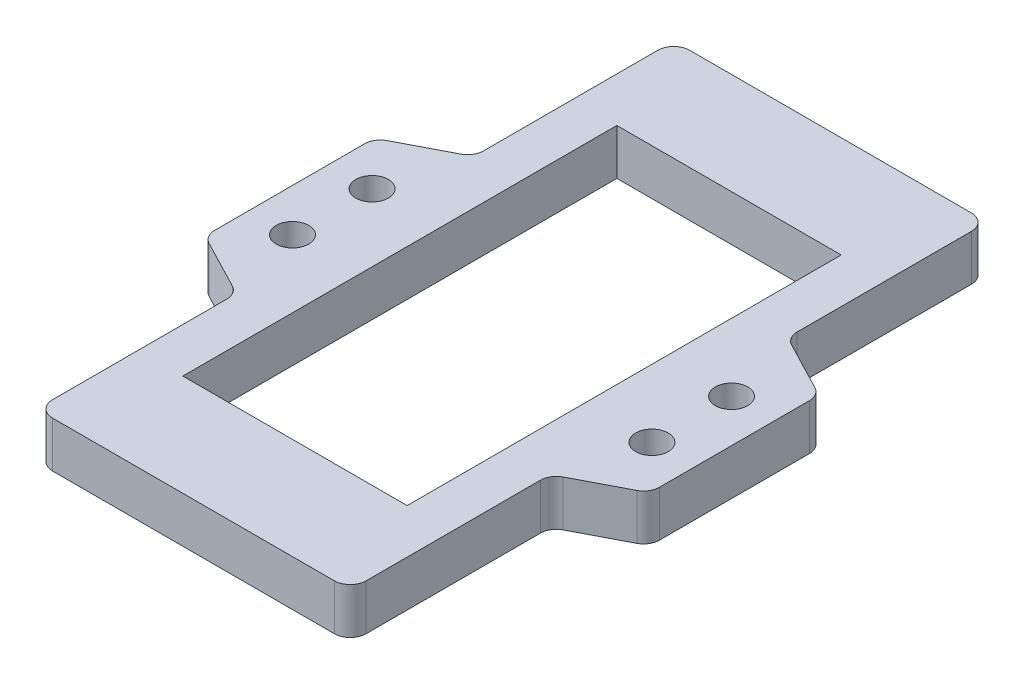
ISO-10303-21;
HEADER;
FILE_DESCRIPTION(('STEP AP214'),'2;1');
FILE_NAME('part.step','',(''),(''),'','','');
FILE_SCHEMA(('AUTOMOTIVE_DESIGN { 1 0 10303 214 1 1 1 1 }'));
ENDSEC;
DATA;
#1=APPLICATION_CONTEXT('core data for automotive mechanical design processes');
#2=APPLICATION_PROTOCOL_DEFINITION('international standard','automotive_design',2000,#1);
#3=PRODUCT_CONTEXT('',#1,'mechanical');
#4=PRODUCT('Part','Part','',(#3));
#5=PRODUCT_RELATED_PRODUCT_CATEGORY('part','',(#4));
#6=PRODUCT_DEFINITION_FORMATION('','',#4);
#7=PRODUCT_DEFINITION_CONTEXT('part definition',#1,'design');
#8=PRODUCT_DEFINITION('design','',#6,#7);
#9=PRODUCT_DEFINITION_SHAPE('','',#8);
#10=(LENGTH_UNIT() NAMED_UNIT(*) SI_UNIT(.MILLI.,.METRE.));
#11=(NAMED_UNIT(*) PLANE_ANGLE_UNIT() SI_UNIT($,.RADIAN.));
#12=(NAMED_UNIT(*) SI_UNIT($,.STERADIAN.) SOLID_ANGLE_UNIT());
#13=UNCERTAINTY_MEASURE_WITH_UNIT(LENGTH_MEASURE(1.E-05),#10,'distance_accuracy_value','');
#14=(GEOMETRIC_REPRESENTATION_CONTEXT(3) GLOBAL_UNCERTAINTY_ASSIGNED_CONTEXT((#13)) GLOBAL_UNIT_ASSIGNED_CONTEXT((#10,
#11,#12)) REPRESENTATION_CONTEXT('',''));
#15=CARTESIAN_POINT('',(0.,0.,0.));
#16=DIRECTION('',(0.,0.,1.));
#17=DIRECTION('',(1.,0.,0.));
#18=AXIS2_PLACEMENT_3D('',#15,#16,#17);
#19=CARTESIAN_POINT('',(0.,7.3152,0.));
#20=DIRECTION('',(0.,1.,0.));
#21=DIRECTION('',(0.,0.,1.));
#22=AXIS2_PLACEMENT_3D('',#19,#20,#21);
#23=PLANE('',#22);
#24=DIRECTION('',(0.,0.,1.));
#25=VECTOR('',#24,1.);
#26=CARTESIAN_POINT('',(-17.885,7.3152,-34.6075));
#27=LINE('',#26,#25);
#28=CARTESIAN_POINT('',(-17.885,7.3152,-34.6075));
#29=VERTEX_POINT('',#28);
#30=CARTESIAN_POINT('',(-17.885,7.3152,34.6075));
#31=VERTEX_POINT('',#30);
#32=EDGE_CURVE('E53',#29,#31,#27,.T.);
#33=ORIENTED_EDGE('',*,*,#32,.F.);
#34=DIRECTION('',(-1.,0.,0.));
#35=VECTOR('',#34,1.);
#36=CARTESIAN_POINT('',(17.885,7.3152,-34.6075));
#37=LINE('',#36,#35);
#38=CARTESIAN_POINT('',(17.885,7.3152,-34.6075));
#39=VERTEX_POINT('',#38);
#40=EDGE_CURVE('E240',#39,#29,#37,.T.);
#41=ORIENTED_EDGE('',*,*,#40,.F.);
#42=DIRECTION('',(0.,0.,-1.));
#43=VECTOR('',#42,1.);
#44=CARTESIAN_POINT('',(17.885,7.3152,-34.6075));
#45=LINE('',#44,#43);
#46=CARTESIAN_POINT('',(17.885,7.3152,34.6075));
#47=VERTEX_POINT('',#46);
#48=EDGE_CURVE('E243',#47,#39,#45,.T.);
#49=ORIENTED_EDGE('',*,*,#48,.F.);
#50=DIRECTION('',(1.,0.,0.));
#51=VECTOR('',#50,1.);
#52=CARTESIAN_POINT('',(17.885,7.3152,34.6075));
#53=LINE('',#52,#51);
#54=EDGE_CURVE('E249',#31,#47,#53,.T.);
#55=ORIENTED_EDGE('',*,*,#54,.F.);
#56=EDGE_LOOP('',(#33,#41,#49,#55));
#57=FACE_BOUND('',#56,.T.);
#58=DIRECTION('',(0.,0.,1.));
#59=VECTOR('',#58,1.);
#60=CARTESIAN_POINT('',(-35.472859966,7.3152,50.8));
#61=LINE('',#60,#59);
#62=CARTESIAN_POINT('',(-35.472859966,7.3152,-11.9477623690497));
#63=VERTEX_POINT('',#62);
#64=CARTESIAN_POINT('',(-35.472859966,7.3152,11.9477623690497));
#65=VERTEX_POINT('',#64);
#66=EDGE_CURVE('E331',#63,#65,#61,.T.);
#67=ORIENTED_EDGE('',*,*,#66,.T.);
#68=CARTESIAN_POINT('',(-32.932859966,7.3152,11.9477623690497));
#69=DIRECTION('',(0.,1.,0.));
#70=DIRECTION('',(0.,0.,1.));
#71=AXIS2_PLACEMENT_3D('',#68,#69,#70);
#72=CIRCLE('',#71,2.54);
#73=CARTESIAN_POINT('',(-34.1044985055158,7.3152,14.2013956872098));
#74=VERTEX_POINT('',#73);
#75=EDGE_CURVE('E403',#65,#74,#72,.T.);
#76=ORIENTED_EDGE('',*,*,#75,.T.);
#77=DIRECTION('',(0.887257211874052,0.,0.461275015557403));
#78=VECTOR('',#77,1.);
#79=CARTESIAN_POINT('',(-35.472859966,7.3152,13.49));
#80=LINE('',#79,#78);
#81=CARTESIAN_POINT('',(-26.3756204872549,7.3152,18.2195521816319));
#82=VERTEX_POINT('',#81);
#83=EDGE_CURVE('E287',#74,#82,#80,.T.);
#84=ORIENTED_EDGE('',*,*,#83,.T.);
#85=CARTESIAN_POINT('',(-27.5472590267708,7.3152,20.473185499792));
#86=DIRECTION('',(0.,1.,0.));
#87=DIRECTION('',(0.,0.,1.));
#88=AXIS2_PLACEMENT_3D('',#85,#86,#87);
#89=CIRCLE('',#88,2.54);
#90=CARTESIAN_POINT('',(-25.0072590267708,7.3152,20.473185499792));
#91=VERTEX_POINT('',#90);
#92=EDGE_CURVE('E449',#82,#91,#89,.F.);
#93=ORIENTED_EDGE('',*,*,#92,.T.);
#94=DIRECTION('',(0.,0.,1.));
#95=VECTOR('',#94,1.);
#96=CARTESIAN_POINT('',(-25.0072590267708,7.3152,18.9309478688417));
#97=LINE('',#96,#95);
#98=CARTESIAN_POINT('',(-25.0072590267708,7.3152,48.26));
#99=VERTEX_POINT('',#98);
#100=EDGE_CURVE('E278',#91,#99,#97,.T.);
#101=ORIENTED_EDGE('',*,*,#100,.T.);
#102=CARTESIAN_POINT('',(-22.4672590267708,7.3152,48.26));
#103=DIRECTION('',(0.,1.,0.));
#104=DIRECTION('',(0.,0.,1.));
#105=AXIS2_PLACEMENT_3D('',#102,#103,#104);
#106=CIRCLE('',#105,2.54);
#107=CARTESIAN_POINT('',(-22.4672590267707,7.3152,50.8));
#108=VERTEX_POINT('',#107);
#109=EDGE_CURVE('E401',#99,#108,#106,.T.);
#110=ORIENTED_EDGE('',*,*,#109,.T.);
#111=DIRECTION('',(1.,0.,0.));
#112=VECTOR('',#111,1.);
#113=CARTESIAN_POINT('',(35.472859966,7.3152,50.8));
#114=LINE('',#113,#112);
#115=CARTESIAN_POINT('',(22.4672590267708,7.3152,50.8));
#116=VERTEX_POINT('',#115);
#117=EDGE_CURVE('E334',#108,#116,#114,.T.);
#118=ORIENTED_EDGE('',*,*,#117,.T.);
#119=CARTESIAN_POINT('',(22.4672590267708,7.3152,48.26));
#120=DIRECTION('',(0.,1.,0.));
#121=DIRECTION('',(0.,0.,1.));
#122=AXIS2_PLACEMENT_3D('',#119,#120,#121);
#123=CIRCLE('',#122,2.54);
#124=CARTESIAN_POINT('',(25.0072590267708,7.3152,48.26));
#125=VERTEX_POINT('',#124);
#126=EDGE_CURVE('E399',#116,#125,#123,.T.);
#127=ORIENTED_EDGE('',*,*,#126,.T.);
#128=DIRECTION('',(0.,0.,1.));
#129=VECTOR('',#128,1.);
#130=CARTESIAN_POINT('',(25.0072590267708,7.3152,18.9309478688417));
#131=LINE('',#130,#129);
#132=CARTESIAN_POINT('',(25.0072590267708,7.3152,20.473185499792));
#133=VERTEX_POINT('',#132);
#134=EDGE_CURVE('E263',#133,#125,#131,.T.);
#135=ORIENTED_EDGE('',*,*,#134,.F.);
#136=CARTESIAN_POINT('',(27.5472590267708,7.3152,20.473185499792));
#137=DIRECTION('',(0.,1.,0.));
#138=DIRECTION('',(0.,0.,1.));
#139=AXIS2_PLACEMENT_3D('',#136,#137,#138);
#140=CIRCLE('',#139,2.54);
#141=CARTESIAN_POINT('',(26.3756204872549,7.3152,18.2195521816319));
#142=VERTEX_POINT('',#141);
#143=EDGE_CURVE('E453',#133,#142,#140,.F.);
#144=ORIENTED_EDGE('',*,*,#143,.T.);
#145=DIRECTION('',(-0.887257211874052,0.,0.461275015557403));
#146=VECTOR('',#145,1.);
#147=CARTESIAN_POINT('',(35.472859966,7.3152,13.49));
#148=LINE('',#147,#146);
#149=CARTESIAN_POINT('',(34.1044985055158,7.3152,14.2013956872098));
#150=VERTEX_POINT('',#149);
#151=EDGE_CURVE('E255',#150,#142,#148,.T.);
#152=ORIENTED_EDGE('',*,*,#151,.F.);
#153=CARTESIAN_POINT('',(32.932859966,7.3152,11.9477623690497));
#154=DIRECTION('',(0.,1.,0.));
#155=DIRECTION('',(0.,0.,1.));
#156=AXIS2_PLACEMENT_3D('',#153,#154,#155);
#157=CIRCLE('',#156,2.54);
#158=CARTESIAN_POINT('',(35.472859966,7.3152,11.9477623690497));
#159=VERTEX_POINT('',#158);
#160=EDGE_CURVE('E397',#150,#159,#157,.T.);
#161=ORIENTED_EDGE('',*,*,#160,.T.);
#162=DIRECTION('',(0.,0.,-1.));
#163=VECTOR('',#162,1.);
#164=CARTESIAN_POINT('',(35.472859966,7.3152,50.8));
#165=LINE('',#164,#163);
#166=CARTESIAN_POINT('',(35.472859966,7.3152,-11.9477623690497));
#167=VERTEX_POINT('',#166);
#168=EDGE_CURVE('E338',#159,#167,#165,.T.);
#169=ORIENTED_EDGE('',*,*,#168,.T.);
#170=CARTESIAN_POINT('',(32.932859966,7.3152,-11.9477623690497));
#171=DIRECTION('',(0.,1.,0.));
#172=DIRECTION('',(0.,0.,1.));
#173=AXIS2_PLACEMENT_3D('',#170,#171,#172);
#174=CIRCLE('',#173,2.54);
#175=CARTESIAN_POINT('',(34.1044985055158,7.3152,-14.2013956872098));
#176=VERTEX_POINT('',#175);
#177=EDGE_CURVE('E395',#167,#176,#174,.T.);
#178=ORIENTED_EDGE('',*,*,#177,.T.);
#179=DIRECTION('',(-0.887257211874052,0.,-0.461275015557403));
#180=VECTOR('',#179,1.);
#181=CARTESIAN_POINT('',(35.472859966,7.3152,-13.49));
#182=LINE('',#181,#180);
#183=CARTESIAN_POINT('',(26.3756204872549,7.3152,-18.2195521816319));
#184=VERTEX_POINT('',#183);
#185=EDGE_CURVE('E275',#176,#184,#182,.T.);
#186=ORIENTED_EDGE('',*,*,#185,.T.);
#187=CARTESIAN_POINT('',(27.5472590267708,7.3152,-20.473185499792));
#188=DIRECTION('',(0.,1.,0.));
#189=DIRECTION('',(0.,0.,1.));
#190=AXIS2_PLACEMENT_3D('',#187,#188,#189);
#191=CIRCLE('',#190,2.54);
#192=CARTESIAN_POINT('',(25.0072590267708,7.3152,-20.473185499792));
#193=VERTEX_POINT('',#192);
#194=EDGE_CURVE('E46',#184,#193,#191,.F.);
#195=ORIENTED_EDGE('',*,*,#194,.T.);
#196=DIRECTION('',(0.,0.,-1.));
#197=VECTOR('',#196,1.);
#198=CARTESIAN_POINT('',(25.0072590267708,7.3152,-18.9309478688417));
#199=LINE('',#198,#197);
#200=CARTESIAN_POINT('',(25.0072590267708,7.3152,-48.26));
#201=VERTEX_POINT('',#200);
#202=EDGE_CURVE('E266',#193,#201,#199,.T.);
#203=ORIENTED_EDGE('',*,*,#202,.T.);
#204=CARTESIAN_POINT('',(22.4672590267708,7.3152,-48.26));
#205=DIRECTION('',(0.,1.,0.));
#206=DIRECTION('',(0.,0.,1.));
#207=AXIS2_PLACEMENT_3D('',#204,#205,#206);
#208=CIRCLE('',#207,2.54);
#209=CARTESIAN_POINT('',(22.4672590267708,7.3152,-50.8));
#210=VERTEX_POINT('',#209);
#211=EDGE_CURVE('E393',#201,#210,#208,.T.);
#212=ORIENTED_EDGE('',*,*,#211,.T.);
#213=DIRECTION('',(-1.,0.,0.));
#214=VECTOR('',#213,1.);
#215=CARTESIAN_POINT('',(35.472859966,7.3152,-50.8));
#216=LINE('',#215,#214);
#217=CARTESIAN_POINT('',(-22.4672590267707,7.3152,-50.8));
#218=VERTEX_POINT('',#217);
#219=EDGE_CURVE('E341',#210,#218,#216,.T.);
#220=ORIENTED_EDGE('',*,*,#219,.T.);
#221=CARTESIAN_POINT('',(-22.4672590267708,7.3152,-48.26));
#222=DIRECTION('',(0.,1.,0.));
#223=DIRECTION('',(0.,0.,1.));
#224=AXIS2_PLACEMENT_3D('',#221,#222,#223);
#225=CIRCLE('',#224,2.54);
#226=CARTESIAN_POINT('',(-25.0072590267708,7.3152,-48.26));
#227=VERTEX_POINT('',#226);
#228=EDGE_CURVE('E357',#218,#227,#225,.T.);
#229=ORIENTED_EDGE('',*,*,#228,.T.);
#230=DIRECTION('',(0.,0.,-1.));
#231=VECTOR('',#230,1.);
#232=CARTESIAN_POINT('',(-25.0072590267708,7.3152,-18.9309478688417));
#233=LINE('',#232,#231);
#234=CARTESIAN_POINT('',(-25.0072590267708,7.3152,-20.473185499792));
#235=VERTEX_POINT('',#234);
#236=EDGE_CURVE('E299',#235,#227,#233,.T.);
#237=ORIENTED_EDGE('',*,*,#236,.F.);
#238=CARTESIAN_POINT('',(-27.5472590267708,7.3152,-20.473185499792));
#239=DIRECTION('',(0.,1.,0.));
#240=DIRECTION('',(0.,0.,1.));
#241=AXIS2_PLACEMENT_3D('',#238,#239,#240);
#242=CIRCLE('',#241,2.54);
#243=CARTESIAN_POINT('',(-26.3756204872549,7.3152,-18.2195521816319));
#244=VERTEX_POINT('',#243);
#245=EDGE_CURVE('E376',#235,#244,#242,.F.);
#246=ORIENTED_EDGE('',*,*,#245,.T.);
#247=DIRECTION('',(0.887257211874052,0.,-0.461275015557403));
#248=VECTOR('',#247,1.);
#249=CARTESIAN_POINT('',(-35.472859966,7.3152,-13.49));
#250=LINE('',#249,#248);
#251=CARTESIAN_POINT('',(-34.1044985055158,7.3152,-14.2013956872098));
#252=VERTEX_POINT('',#251);
#253=EDGE_CURVE('E290',#252,#244,#250,.T.);
#254=ORIENTED_EDGE('',*,*,#253,.F.);
#255=CARTESIAN_POINT('',(-32.932859966,7.3152,-11.9477623690497));
#256=DIRECTION('',(0.,1.,0.));
#257=DIRECTION('',(0.,0.,1.));
#258=AXIS2_PLACEMENT_3D('',#255,#256,#257);
#259=CIRCLE('',#258,2.54);
#260=EDGE_CURVE('E359',#252,#63,#259,.T.);
#261=ORIENTED_EDGE('',*,*,#260,.T.);
#262=EDGE_LOOP('',(#67,#76,#84,#93,#101,#110,#118,#127,#135,#144,#152,#161,#169,#178,#186,#195,
#203,#212,#220,#229,#237,#246,#254,#261));
#263=FACE_BOUND('',#262,.T.);
#264=CARTESIAN_POINT('',(28.662459966,7.3152,6.34999999999998));
#265=DIRECTION('',(0.,1.,0.));
#266=DIRECTION('',(0.,0.,1.));
#267=AXIS2_PLACEMENT_3D('',#264,#265,#266);
#268=CIRCLE('',#267,2.59079999999998);
#269=CARTESIAN_POINT('',(28.662459966,7.3152,8.94079999999997));
#270=VERTEX_POINT('',#269);
#271=EDGE_CURVE('E302',#270,#270,#268,.T.);
#272=ORIENTED_EDGE('',*,*,#271,.F.);
#273=EDGE_LOOP('',(#272));
#274=FACE_BOUND('',#273,.T.);
#275=CARTESIAN_POINT('',(28.662459966,7.3152,-6.35000000000002));
#276=DIRECTION('',(0.,1.,0.));
#277=DIRECTION('',(0.,0.,1.));
#278=AXIS2_PLACEMENT_3D('',#275,#276,#277);
#279=CIRCLE('',#278,2.59079999999998);
#280=CARTESIAN_POINT('',(28.662459966,7.3152,-3.75920000000003));
#281=VERTEX_POINT('',#280);
#282=EDGE_CURVE('E312',#281,#281,#279,.T.);
#283=ORIENTED_EDGE('',*,*,#282,.F.);
#284=EDGE_LOOP('',(#283));
#285=FACE_BOUND('',#284,.T.);
#286=CARTESIAN_POINT('',(-28.662459966,7.3152,6.34999999999998));
#287=DIRECTION('',(0.,1.,0.));
#288=DIRECTION('',(0.,0.,1.));
#289=AXIS2_PLACEMENT_3D('',#286,#287,#288);
#290=CIRCLE('',#289,2.59079999999999);
#291=CARTESIAN_POINT('',(-28.662459966,7.3152,8.94079999999997));
#292=VERTEX_POINT('',#291);
#293=EDGE_CURVE('E318',#292,#292,#290,.T.);
#294=ORIENTED_EDGE('',*,*,#293,.F.);
#295=EDGE_LOOP('',(#294));
#296=FACE_BOUND('',#295,.T.);
#297=CARTESIAN_POINT('',(-28.662459966,7.3152,-6.35000000000002));
#298=DIRECTION('',(0.,1.,0.));
#299=DIRECTION('',(0.,0.,1.));
#300=AXIS2_PLACEMENT_3D('',#297,#298,#299);
#301=CIRCLE('',#300,2.59079999999999);
#302=CARTESIAN_POINT('',(-28.662459966,7.3152,-3.75920000000003));
#303=VERTEX_POINT('',#302);
#304=EDGE_CURVE('E324',#303,#303,#301,.T.);
#305=ORIENTED_EDGE('',*,*,#304,.F.);
#306=EDGE_LOOP('',(#305));
#307=FACE_BOUND('',#306,.T.);
#308=ADVANCED_FACE('F38',(#57,#263,#274,#285,#296,#307),#23,.T.);
#309=CARTESIAN_POINT('',(0.,0.,0.));
#310=DIRECTION('',(0.,1.,0.));
#311=DIRECTION('',(0.,0.,1.));
#312=AXIS2_PLACEMENT_3D('',#309,#310,#311);
#313=PLANE('',#312);
#314=DIRECTION('',(-1.,0.,0.));
#315=VECTOR('',#314,1.);
#316=CARTESIAN_POINT('',(17.885,0.,-34.6075));
#317=LINE('',#316,#315);
#318=CARTESIAN_POINT('',(17.885,0.,-34.6075));
#319=VERTEX_POINT('',#318);
#320=CARTESIAN_POINT('',(-17.885,0.,-34.6075));
#321=VERTEX_POINT('',#320);
#322=EDGE_CURVE('E230',#319,#321,#317,.T.);
#323=ORIENTED_EDGE('',*,*,#322,.T.);
#324=DIRECTION('',(0.,0.,1.));
#325=VECTOR('',#324,1.);
#326=CARTESIAN_POINT('',(-17.885,0.,-34.6075));
#327=LINE('',#326,#325);
#328=CARTESIAN_POINT('',(-17.885,0.,34.6075));
#329=VERTEX_POINT('',#328);
#330=EDGE_CURVE('E224',#321,#329,#327,.T.);
#331=ORIENTED_EDGE('',*,*,#330,.T.);
#332=DIRECTION('',(1.,0.,0.));
#333=VECTOR('',#332,1.);
#334=CARTESIAN_POINT('',(17.885,0.,34.6075));
#335=LINE('',#334,#333);
#336=CARTESIAN_POINT('',(17.885,0.,34.6075));
#337=VERTEX_POINT('',#336);
#338=EDGE_CURVE('E233',#329,#337,#335,.T.);
#339=ORIENTED_EDGE('',*,*,#338,.T.);
#340=DIRECTION('',(0.,0.,-1.));
#341=VECTOR('',#340,1.);
#342=CARTESIAN_POINT('',(17.885,0.,-34.6075));
#343=LINE('',#342,#341);
#344=EDGE_CURVE('E61',#337,#319,#343,.T.);
#345=ORIENTED_EDGE('',*,*,#344,.T.);
#346=EDGE_LOOP('',(#323,#331,#339,#345));
#347=FACE_BOUND('',#346,.T.);
#348=CARTESIAN_POINT('',(28.662459966,0.,6.34999999999998));
#349=DIRECTION('',(0.,1.,0.));
#350=DIRECTION('',(0.,0.,1.));
#351=AXIS2_PLACEMENT_3D('',#348,#349,#350);
#352=CIRCLE('',#351,2.5908);
#353=CARTESIAN_POINT('',(28.662459966,0.,8.94079999999998));
#354=VERTEX_POINT('',#353);
#355=EDGE_CURVE('E309',#354,#354,#352,.T.);
#356=ORIENTED_EDGE('',*,*,#355,.T.);
#357=EDGE_LOOP('',(#356));
#358=FACE_BOUND('',#357,.T.);
#359=CARTESIAN_POINT('',(28.662459966,0.,-6.35000000000002));
#360=DIRECTION('',(0.,1.,0.));
#361=DIRECTION('',(0.,0.,1.));
#362=AXIS2_PLACEMENT_3D('',#359,#360,#361);
#363=CIRCLE('',#362,2.5908);
#364=CARTESIAN_POINT('',(28.662459966,0.,-3.75920000000002));
#365=VERTEX_POINT('',#364);
#366=EDGE_CURVE('E315',#365,#365,#363,.T.);
#367=ORIENTED_EDGE('',*,*,#366,.T.);
#368=EDGE_LOOP('',(#367));
#369=FACE_BOUND('',#368,.T.);
#370=CARTESIAN_POINT('',(-28.662459966,0.,6.34999999999998));
#371=DIRECTION('',(0.,1.,0.));
#372=DIRECTION('',(0.,0.,1.));
#373=AXIS2_PLACEMENT_3D('',#370,#371,#372);
#374=CIRCLE('',#373,2.5908);
#375=CARTESIAN_POINT('',(-28.662459966,0.,8.94079999999998));
#376=VERTEX_POINT('',#375);
#377=EDGE_CURVE('E321',#376,#376,#374,.T.);
#378=ORIENTED_EDGE('',*,*,#377,.T.);
#379=EDGE_LOOP('',(#378));
#380=FACE_BOUND('',#379,.T.);
#381=CARTESIAN_POINT('',(-28.662459966,0.,-6.35000000000002));
#382=DIRECTION('',(0.,1.,0.));
#383=DIRECTION('',(0.,0.,1.));
#384=AXIS2_PLACEMENT_3D('',#381,#382,#383);
#385=CIRCLE('',#384,2.5908);
#386=CARTESIAN_POINT('',(-28.662459966,0.,-3.75920000000002));
#387=VERTEX_POINT('',#386);
#388=EDGE_CURVE('E327',#387,#387,#385,.T.);
#389=ORIENTED_EDGE('',*,*,#388,.T.);
#390=EDGE_LOOP('',(#389));
#391=FACE_BOUND('',#390,.T.);
#392=DIRECTION('',(0.887257211874052,0.,0.461275015557403));
#393=VECTOR('',#392,1.);
#394=CARTESIAN_POINT('',(-35.472859966,0.,13.49));
#395=LINE('',#394,#393);
#396=CARTESIAN_POINT('',(-34.1044985055158,0.,14.2013956872098));
#397=VERTEX_POINT('',#396);
#398=CARTESIAN_POINT('',(-26.3756204872549,0.,18.2195521816319));
#399=VERTEX_POINT('',#398);
#400=EDGE_CURVE('E286',#397,#399,#395,.T.);
#401=ORIENTED_EDGE('',*,*,#400,.F.);
#402=CARTESIAN_POINT('',(-32.932859966,0.,11.9477623690497));
#403=DIRECTION('',(0.,1.,0.));
#404=DIRECTION('',(0.,0.,1.));
#405=AXIS2_PLACEMENT_3D('',#402,#403,#404);
#406=CIRCLE('',#405,2.54);
#407=CARTESIAN_POINT('',(-35.472859966,0.,11.9477623690497));
#408=VERTEX_POINT('',#407);
#409=EDGE_CURVE('E415',#397,#408,#406,.F.);
#410=ORIENTED_EDGE('',*,*,#409,.T.);
#411=DIRECTION('',(0.,0.,1.));
#412=VECTOR('',#411,1.);
#413=CARTESIAN_POINT('',(-35.472859966,0.,50.8));
#414=LINE('',#413,#412);
#415=CARTESIAN_POINT('',(-35.472859966,0.,-11.9477623690497));
#416=VERTEX_POINT('',#415);
#417=EDGE_CURVE('E330',#416,#408,#414,.T.);
#418=ORIENTED_EDGE('',*,*,#417,.F.);
#419=CARTESIAN_POINT('',(-32.932859966,0.,-11.9477623690497));
#420=DIRECTION('',(0.,1.,0.));
#421=DIRECTION('',(0.,0.,1.));
#422=AXIS2_PLACEMENT_3D('',#419,#420,#421);
#423=CIRCLE('',#422,2.54);
#424=CARTESIAN_POINT('',(-34.1044985055158,0.,-14.2013956872098));
#425=VERTEX_POINT('',#424);
#426=EDGE_CURVE('E366',#416,#425,#423,.F.);
#427=ORIENTED_EDGE('',*,*,#426,.T.);
#428=DIRECTION('',(0.887257211874052,0.,-0.461275015557403));
#429=VECTOR('',#428,1.);
#430=CARTESIAN_POINT('',(-35.472859966,0.,-13.49));
#431=LINE('',#430,#429);
#432=CARTESIAN_POINT('',(-26.3756204872549,0.,-18.2195521816319));
#433=VERTEX_POINT('',#432);
#434=EDGE_CURVE('E295',#425,#433,#431,.T.);
#435=ORIENTED_EDGE('',*,*,#434,.T.);
#436=CARTESIAN_POINT('',(-27.5472590267708,0.,-20.473185499792));
#437=DIRECTION('',(0.,1.,0.));
#438=DIRECTION('',(0.,0.,1.));
#439=AXIS2_PLACEMENT_3D('',#436,#437,#438);
#440=CIRCLE('',#439,2.54);
#441=CARTESIAN_POINT('',(-25.0072590267708,0.,-20.473185499792));
#442=VERTEX_POINT('',#441);
#443=EDGE_CURVE('E378',#433,#442,#440,.T.);
#444=ORIENTED_EDGE('',*,*,#443,.T.);
#445=DIRECTION('',(0.,0.,-1.));
#446=VECTOR('',#445,1.);
#447=CARTESIAN_POINT('',(-25.0072590267708,0.,-18.9309478688417));
#448=LINE('',#447,#446);
#449=CARTESIAN_POINT('',(-25.0072590267708,0.,-48.26));
#450=VERTEX_POINT('',#449);
#451=EDGE_CURVE('E298',#442,#450,#448,.T.);
#452=ORIENTED_EDGE('',*,*,#451,.T.);
#453=CARTESIAN_POINT('',(-22.4672590267708,0.,-48.26));
#454=DIRECTION('',(0.,1.,0.));
#455=DIRECTION('',(0.,0.,1.));
#456=AXIS2_PLACEMENT_3D('',#453,#454,#455);
#457=CIRCLE('',#456,2.54);
#458=CARTESIAN_POINT('',(-22.4672590267707,0.,-50.8));
#459=VERTEX_POINT('',#458);
#460=EDGE_CURVE('E363',#450,#459,#457,.F.);
#461=ORIENTED_EDGE('',*,*,#460,.T.);
#462=DIRECTION('',(-1.,0.,0.));
#463=VECTOR('',#462,1.);
#464=CARTESIAN_POINT('',(35.472859966,0.,-50.8));
#465=LINE('',#464,#463);
#466=CARTESIAN_POINT('',(22.4672590267708,0.,-50.8));
#467=VERTEX_POINT('',#466);
#468=EDGE_CURVE('E335',#467,#459,#465,.T.);
#469=ORIENTED_EDGE('',*,*,#468,.F.);
#470=CARTESIAN_POINT('',(22.4672590267708,0.,-48.26));
#471=DIRECTION('',(0.,1.,0.));
#472=DIRECTION('',(0.,0.,1.));
#473=AXIS2_PLACEMENT_3D('',#470,#471,#472);
#474=CIRCLE('',#473,2.54);
#475=CARTESIAN_POINT('',(25.0072590267708,0.,-48.26));
#476=VERTEX_POINT('',#475);
#477=EDGE_CURVE('E405',#467,#476,#474,.F.);
#478=ORIENTED_EDGE('',*,*,#477,.T.);
#479=DIRECTION('',(0.,0.,-1.));
#480=VECTOR('',#479,1.);
#481=CARTESIAN_POINT('',(25.0072590267708,0.,-18.9309478688417));
#482=LINE('',#481,#480);
#483=CARTESIAN_POINT('',(25.0072590267708,0.,-20.473185499792));
#484=VERTEX_POINT('',#483);
#485=EDGE_CURVE('E271',#484,#476,#482,.T.);
#486=ORIENTED_EDGE('',*,*,#485,.F.);
#487=CARTESIAN_POINT('',(27.5472590267708,0.,-20.473185499792));
#488=DIRECTION('',(0.,1.,0.));
#489=DIRECTION('',(0.,0.,1.));
#490=AXIS2_PLACEMENT_3D('',#487,#488,#489);
#491=CIRCLE('',#490,2.54);
#492=CARTESIAN_POINT('',(26.3756204872549,0.,-18.2195521816319));
#493=VERTEX_POINT('',#492);
#494=EDGE_CURVE('E11',#484,#493,#491,.T.);
#495=ORIENTED_EDGE('',*,*,#494,.T.);
#496=DIRECTION('',(-0.887257211874052,0.,-0.461275015557403));
#497=VECTOR('',#496,1.);
#498=CARTESIAN_POINT('',(35.472859966,0.,-13.49));
#499=LINE('',#498,#497);
#500=CARTESIAN_POINT('',(34.1044985055158,0.,-14.2013956872098));
#501=VERTEX_POINT('',#500);
#502=EDGE_CURVE('E274',#501,#493,#499,.T.);
#503=ORIENTED_EDGE('',*,*,#502,.F.);
#504=CARTESIAN_POINT('',(32.932859966,0.,-11.9477623690497));
#505=DIRECTION('',(0.,1.,0.));
#506=DIRECTION('',(0.,0.,1.));
#507=AXIS2_PLACEMENT_3D('',#504,#505,#506);
#508=CIRCLE('',#507,2.54);
#509=CARTESIAN_POINT('',(35.472859966,0.,-11.9477623690497));
#510=VERTEX_POINT('',#509);
#511=EDGE_CURVE('E407',#501,#510,#508,.F.);
#512=ORIENTED_EDGE('',*,*,#511,.T.);
#513=DIRECTION('',(0.,0.,-1.));
#514=VECTOR('',#513,1.);
#515=CARTESIAN_POINT('',(35.472859966,0.,50.8));
#516=LINE('',#515,#514);
#517=CARTESIAN_POINT('',(35.472859966,0.,11.9477623690497));
#518=VERTEX_POINT('',#517);
#519=EDGE_CURVE('E349',#518,#510,#516,.T.);
#520=ORIENTED_EDGE('',*,*,#519,.F.);
#521=CARTESIAN_POINT('',(32.932859966,0.,11.9477623690497));
#522=DIRECTION('',(0.,1.,0.));
#523=DIRECTION('',(0.,0.,1.));
#524=AXIS2_PLACEMENT_3D('',#521,#522,#523);
#525=CIRCLE('',#524,2.54);
#526=CARTESIAN_POINT('',(34.1044985055158,0.,14.2013956872098));
#527=VERTEX_POINT('',#526);
#528=EDGE_CURVE('E409',#518,#527,#525,.F.);
#529=ORIENTED_EDGE('',*,*,#528,.T.);
#530=DIRECTION('',(-0.887257211874052,0.,0.461275015557403));
#531=VECTOR('',#530,1.);
#532=CARTESIAN_POINT('',(35.472859966,0.,13.49));
#533=LINE('',#532,#531);
#534=CARTESIAN_POINT('',(26.3756204872549,0.,18.2195521816319));
#535=VERTEX_POINT('',#534);
#536=EDGE_CURVE('E259',#527,#535,#533,.T.);
#537=ORIENTED_EDGE('',*,*,#536,.T.);
#538=CARTESIAN_POINT('',(27.5472590267708,0.,20.473185499792));
#539=DIRECTION('',(0.,1.,0.));
#540=DIRECTION('',(0.,0.,1.));
#541=AXIS2_PLACEMENT_3D('',#538,#539,#540);
#542=CIRCLE('',#541,2.54);
#543=CARTESIAN_POINT('',(25.0072590267708,0.,20.473185499792));
#544=VERTEX_POINT('',#543);
#545=EDGE_CURVE('E455',#535,#544,#542,.T.);
#546=ORIENTED_EDGE('',*,*,#545,.T.);
#547=DIRECTION('',(0.,0.,1.));
#548=VECTOR('',#547,1.);
#549=CARTESIAN_POINT('',(25.0072590267708,0.,18.9309478688417));
#550=LINE('',#549,#548);
#551=CARTESIAN_POINT('',(25.0072590267708,0.,48.26));
#552=VERTEX_POINT('',#551);
#553=EDGE_CURVE('E262',#544,#552,#550,.T.);
#554=ORIENTED_EDGE('',*,*,#553,.T.);
#555=CARTESIAN_POINT('',(22.4672590267708,0.,48.26));
#556=DIRECTION('',(0.,1.,0.));
#557=DIRECTION('',(0.,0.,1.));
#558=AXIS2_PLACEMENT_3D('',#555,#556,#557);
#559=CIRCLE('',#558,2.54);
#560=CARTESIAN_POINT('',(22.4672590267708,0.,50.8));
#561=VERTEX_POINT('',#560);
#562=EDGE_CURVE('E411',#552,#561,#559,.F.);
#563=ORIENTED_EDGE('',*,*,#562,.T.);
#564=DIRECTION('',(1.,0.,0.));
#565=VECTOR('',#564,1.);
#566=CARTESIAN_POINT('',(35.472859966,0.,50.8));
#567=LINE('',#566,#565);
#568=CARTESIAN_POINT('',(-22.4672590267707,0.,50.8));
#569=VERTEX_POINT('',#568);
#570=EDGE_CURVE('E346',#569,#561,#567,.T.);
#571=ORIENTED_EDGE('',*,*,#570,.F.);
#572=CARTESIAN_POINT('',(-22.4672590267708,0.,48.26));
#573=DIRECTION('',(0.,1.,0.));
#574=DIRECTION('',(0.,0.,1.));
#575=AXIS2_PLACEMENT_3D('',#572,#573,#574);
#576=CIRCLE('',#575,2.54);
#577=CARTESIAN_POINT('',(-25.0072590267708,0.,48.26));
#578=VERTEX_POINT('',#577);
#579=EDGE_CURVE('E413',#569,#578,#576,.F.);
#580=ORIENTED_EDGE('',*,*,#579,.T.);
#581=DIRECTION('',(0.,0.,1.));
#582=VECTOR('',#581,1.);
#583=CARTESIAN_POINT('',(-25.0072590267708,0.,18.9309478688417));
#584=LINE('',#583,#582);
#585=CARTESIAN_POINT('',(-25.0072590267708,0.,20.473185499792));
#586=VERTEX_POINT('',#585);
#587=EDGE_CURVE('E283',#586,#578,#584,.T.);
#588=ORIENTED_EDGE('',*,*,#587,.F.);
#589=CARTESIAN_POINT('',(-27.5472590267708,0.,20.473185499792));
#590=DIRECTION('',(0.,1.,0.));
#591=DIRECTION('',(0.,0.,1.));
#592=AXIS2_PLACEMENT_3D('',#589,#590,#591);
#593=CIRCLE('',#592,2.54);
#594=EDGE_CURVE('E451',#586,#399,#593,.T.);
#595=ORIENTED_EDGE('',*,*,#594,.T.);
#596=EDGE_LOOP('',(#401,#410,#418,#427,#435,#444,#452,#461,#469,#478,#486,#495,#503,#512,#520,
#529,#537,#546,#554,#563,#571,#580,#588,#595));
#597=FACE_BOUND('',#596,.T.);
#598=ADVANCED_FACE('F237',(#347,#358,#369,#380,#391,#597),#313,.F.);
#599=CARTESIAN_POINT('',(35.472859966,7.3152,50.8));
#600=DIRECTION('',(-1.,0.,0.));
#601=DIRECTION('',(0.,0.,1.));
#602=AXIS2_PLACEMENT_3D('',#599,#600,#601);
#603=PLANE('',#602);
#604=ORIENTED_EDGE('',*,*,#168,.F.);
#605=DIRECTION('',(0.,1.,0.));
#606=VECTOR('',#605,1.);
#607=CARTESIAN_POINT('',(35.472859966,7.3152,11.9477623690497));
#608=LINE('',#607,#606);
#609=EDGE_CURVE('E435',#159,#518,#608,.F.);
#610=ORIENTED_EDGE('',*,*,#609,.T.);
#611=ORIENTED_EDGE('',*,*,#519,.T.);
#612=DIRECTION('',(0.,1.,0.));
#613=VECTOR('',#612,1.);
#614=CARTESIAN_POINT('',(35.472859966,7.3152,-11.9477623690497));
#615=LINE('',#614,#613);
#616=EDGE_CURVE('E432',#510,#167,#615,.T.);
#617=ORIENTED_EDGE('',*,*,#616,.T.);
#618=EDGE_LOOP('',(#604,#610,#611,#617));
#619=FACE_BOUND('',#618,.T.);
#620=ADVANCED_FACE('F483',(#619),#603,.F.);
#621=CARTESIAN_POINT('',(35.472859966,7.3152,-50.8));
#622=DIRECTION('',(0.,0.,1.));
#623=DIRECTION('',(1.,0.,0.));
#624=AXIS2_PLACEMENT_3D('',#621,#622,#623);
#625=PLANE('',#624);
#626=ORIENTED_EDGE('',*,*,#219,.F.);
#627=DIRECTION('',(0.,1.,0.));
#628=VECTOR('',#627,1.);
#629=CARTESIAN_POINT('',(22.4672590267708,0.,-50.8));
#630=LINE('',#629,#628);
#631=EDGE_CURVE('E447',#210,#467,#630,.F.);
#632=ORIENTED_EDGE('',*,*,#631,.T.);
#633=ORIENTED_EDGE('',*,*,#468,.T.);
#634=DIRECTION('',(0.,1.,0.));
#635=VECTOR('',#634,1.);
#636=CARTESIAN_POINT('',(-22.4672590267708,7.3152,-50.8));
#637=LINE('',#636,#635);
#638=EDGE_CURVE('E368',#459,#218,#637,.T.);
#639=ORIENTED_EDGE('',*,*,#638,.T.);
#640=EDGE_LOOP('',(#626,#632,#633,#639));
#641=FACE_BOUND('',#640,.T.);
#642=ADVANCED_FACE('F566',(#641),#625,.F.);
#643=CARTESIAN_POINT('',(-35.472859966,7.3152,50.8));
#644=DIRECTION('',(1.,0.,0.));
#645=DIRECTION('',(0.,0.,-1.));
#646=AXIS2_PLACEMENT_3D('',#643,#644,#645);
#647=PLANE('',#646);
#648=ORIENTED_EDGE('',*,*,#417,.T.);
#649=DIRECTION('',(0.,1.,0.));
#650=VECTOR('',#649,1.);
#651=CARTESIAN_POINT('',(-35.472859966,7.3152,11.9477623690497));
#652=LINE('',#651,#650);
#653=EDGE_CURVE('E390',#408,#65,#652,.T.);
#654=ORIENTED_EDGE('',*,*,#653,.T.);
#655=ORIENTED_EDGE('',*,*,#66,.F.);
#656=DIRECTION('',(0.,1.,0.));
#657=VECTOR('',#656,1.);
#658=CARTESIAN_POINT('',(-35.472859966,7.3152,-11.9477623690497));
#659=LINE('',#658,#657);
#660=EDGE_CURVE('E361',#63,#416,#659,.F.);
#661=ORIENTED_EDGE('',*,*,#660,.T.);
#662=EDGE_LOOP('',(#648,#654,#655,#661));
#663=FACE_BOUND('',#662,.T.);
#664=ADVANCED_FACE('F535',(#663),#647,.F.);
#665=CARTESIAN_POINT('',(35.472859966,7.3152,50.8));
#666=DIRECTION('',(0.,0.,-1.));
#667=DIRECTION('',(-1.,0.,0.));
#668=AXIS2_PLACEMENT_3D('',#665,#666,#667);
#669=PLANE('',#668);
#670=ORIENTED_EDGE('',*,*,#117,.F.);
#671=DIRECTION('',(0.,1.,0.));
#672=VECTOR('',#671,1.);
#673=CARTESIAN_POINT('',(-22.4672590267708,0.,50.8));
#674=LINE('',#673,#672);
#675=EDGE_CURVE('E420',#108,#569,#674,.F.);
#676=ORIENTED_EDGE('',*,*,#675,.T.);
#677=ORIENTED_EDGE('',*,*,#570,.T.);
#678=DIRECTION('',(0.,1.,0.));
#679=VECTOR('',#678,1.);
#680=CARTESIAN_POINT('',(22.4672590267708,7.3152,50.8));
#681=LINE('',#680,#679);
#682=EDGE_CURVE('E417',#561,#116,#681,.T.);
#683=ORIENTED_EDGE('',*,*,#682,.T.);
#684=EDGE_LOOP('',(#670,#676,#677,#683));
#685=FACE_BOUND('',#684,.T.);
#686=ADVANCED_FACE('F510',(#685),#669,.F.);
#687=CARTESIAN_POINT('',(-28.662459966,7.3152,-6.35000000000002));
#688=DIRECTION('',(0.,1.,0.));
#689=DIRECTION('',(0.,0.,1.));
#690=AXIS2_PLACEMENT_3D('',#687,#688,#689);
#691=CYLINDRICAL_SURFACE('',#690,2.59079999999999);
#692=ORIENTED_EDGE('',*,*,#388,.F.);
#693=EDGE_LOOP('',(#692));
#694=FACE_BOUND('',#693,.T.);
#695=ORIENTED_EDGE('',*,*,#304,.T.);
#696=EDGE_LOOP('',(#695));
#697=FACE_BOUND('',#696,.T.);
#698=ADVANCED_FACE('F583',(#694,#697),#691,.F.);
#699=CARTESIAN_POINT('',(-28.662459966,7.3152,6.34999999999998));
#700=DIRECTION('',(0.,1.,0.));
#701=DIRECTION('',(0.,0.,1.));
#702=AXIS2_PLACEMENT_3D('',#699,#700,#701);
#703=CYLINDRICAL_SURFACE('',#702,2.59079999999999);
#704=ORIENTED_EDGE('',*,*,#377,.F.);
#705=EDGE_LOOP('',(#704));
#706=FACE_BOUND('',#705,.T.);
#707=ORIENTED_EDGE('',*,*,#293,.T.);
#708=EDGE_LOOP('',(#707));
#709=FACE_BOUND('',#708,.T.);
#710=ADVANCED_FACE('F586',(#706,#709),#703,.F.);
#711=CARTESIAN_POINT('',(28.662459966,7.3152,-6.35000000000002));
#712=DIRECTION('',(0.,1.,0.));
#713=DIRECTION('',(0.,0.,1.));
#714=AXIS2_PLACEMENT_3D('',#711,#712,#713);
#715=CYLINDRICAL_SURFACE('',#714,2.59079999999999);
#716=ORIENTED_EDGE('',*,*,#366,.F.);
#717=EDGE_LOOP('',(#716));
#718=FACE_BOUND('',#717,.T.);
#719=ORIENTED_EDGE('',*,*,#282,.T.);
#720=EDGE_LOOP('',(#719));
#721=FACE_BOUND('',#720,.T.);
#722=ADVANCED_FACE('F590',(#718,#721),#715,.F.);
#723=CARTESIAN_POINT('',(28.662459966,7.3152,6.34999999999998));
#724=DIRECTION('',(0.,1.,0.));
#725=DIRECTION('',(0.,0.,1.));
#726=AXIS2_PLACEMENT_3D('',#723,#724,#725);
#727=CYLINDRICAL_SURFACE('',#726,2.59079999999999);
#728=ORIENTED_EDGE('',*,*,#355,.F.);
#729=EDGE_LOOP('',(#728));
#730=FACE_BOUND('',#729,.T.);
#731=ORIENTED_EDGE('',*,*,#271,.T.);
#732=EDGE_LOOP('',(#731));
#733=FACE_BOUND('',#732,.T.);
#734=ADVANCED_FACE('F594',(#730,#733),#727,.F.);
#735=CARTESIAN_POINT('',(-25.0072590267708,0.,-18.9309478688417));
#736=DIRECTION('',(1.,0.,0.));
#737=DIRECTION('',(0.,0.,-1.));
#738=AXIS2_PLACEMENT_3D('',#735,#736,#737);
#739=PLANE('',#738);
#740=ORIENTED_EDGE('',*,*,#236,.T.);
#741=DIRECTION('',(0.,1.,0.));
#742=VECTOR('',#741,1.);
#743=CARTESIAN_POINT('',(-25.0072590267708,0.,-48.26));
#744=LINE('',#743,#742);
#745=EDGE_CURVE('E374',#227,#450,#744,.F.);
#746=ORIENTED_EDGE('',*,*,#745,.T.);
#747=ORIENTED_EDGE('',*,*,#451,.F.);
#748=DIRECTION('',(0.,1.,0.));
#749=VECTOR('',#748,1.);
#750=CARTESIAN_POINT('',(-25.0072590267708,7.3152,-20.473185499792));
#751=LINE('',#750,#749);
#752=EDGE_CURVE('E371',#442,#235,#751,.T.);
#753=ORIENTED_EDGE('',*,*,#752,.T.);
#754=EDGE_LOOP('',(#740,#746,#747,#753));
#755=FACE_BOUND('',#754,.T.);
#756=ADVANCED_FACE('F553',(#755),#739,.F.);
#757=CARTESIAN_POINT('',(-35.472859966,0.,-13.49));
#758=DIRECTION('',(0.461275015557403,0.,0.887257211874052));
#759=DIRECTION('',(0.887257211874052,0.,-0.461275015557403));
#760=AXIS2_PLACEMENT_3D('',#757,#758,#759);
#761=PLANE('',#760);
#762=ORIENTED_EDGE('',*,*,#434,.F.);
#763=DIRECTION('',(0.,1.,0.));
#764=VECTOR('',#763,1.);
#765=CARTESIAN_POINT('',(-34.1044985055158,0.,-14.2013956872098));
#766=LINE('',#765,#764);
#767=EDGE_CURVE('E354',#425,#252,#766,.T.);
#768=ORIENTED_EDGE('',*,*,#767,.T.);
#769=ORIENTED_EDGE('',*,*,#253,.T.);
#770=DIRECTION('',(0.,1.,0.));
#771=VECTOR('',#770,1.);
#772=CARTESIAN_POINT('',(-26.3756204872549,0.,-18.2195521816319));
#773=LINE('',#772,#771);
#774=EDGE_CURVE('E343',#244,#433,#773,.F.);
#775=ORIENTED_EDGE('',*,*,#774,.T.);
#776=EDGE_LOOP('',(#762,#768,#769,#775));
#777=FACE_BOUND('',#776,.T.);
#778=ADVANCED_FACE('F544',(#777),#761,.F.);
#779=CARTESIAN_POINT('',(-32.932859966,0.,-11.9477623690497));
#780=DIRECTION('',(0.,1.,0.));
#781=DIRECTION('',(0.,0.,1.));
#782=AXIS2_PLACEMENT_3D('',#779,#780,#781);
#783=CYLINDRICAL_SURFACE('',#782,2.54);
#784=ORIENTED_EDGE('',*,*,#426,.F.);
#785=ORIENTED_EDGE('',*,*,#660,.F.);
#786=ORIENTED_EDGE('',*,*,#260,.F.);
#787=ORIENTED_EDGE('',*,*,#767,.F.);
#788=EDGE_LOOP('',(#784,#785,#786,#787));
#789=FACE_BOUND('',#788,.T.);
#790=ADVANCED_FACE('F539',(#789),#783,.T.);
#791=CARTESIAN_POINT('',(-22.4672590267708,7.3152,-48.26));
#792=DIRECTION('',(0.,1.,0.));
#793=DIRECTION('',(0.,0.,1.));
#794=AXIS2_PLACEMENT_3D('',#791,#792,#793);
#795=CYLINDRICAL_SURFACE('',#794,2.54);
#796=ORIENTED_EDGE('',*,*,#460,.F.);
#797=ORIENTED_EDGE('',*,*,#745,.F.);
#798=ORIENTED_EDGE('',*,*,#228,.F.);
#799=ORIENTED_EDGE('',*,*,#638,.F.);
#800=EDGE_LOOP('',(#796,#797,#798,#799));
#801=FACE_BOUND('',#800,.T.);
#802=ADVANCED_FACE('F558',(#801),#795,.T.);
#803=CARTESIAN_POINT('',(-27.5472590267708,0.,-20.473185499792));
#804=DIRECTION('',(0.,-1.,0.));
#805=DIRECTION('',(0.,0.,-1.));
#806=AXIS2_PLACEMENT_3D('',#803,#804,#805);
#807=CYLINDRICAL_SURFACE('',#806,2.54);
#808=ORIENTED_EDGE('',*,*,#443,.F.);
#809=ORIENTED_EDGE('',*,*,#774,.F.);
#810=ORIENTED_EDGE('',*,*,#245,.F.);
#811=ORIENTED_EDGE('',*,*,#752,.F.);
#812=EDGE_LOOP('',(#808,#809,#810,#811));
#813=FACE_BOUND('',#812,.T.);
#814=ADVANCED_FACE('F548',(#813),#807,.F.);
#815=CARTESIAN_POINT('',(-35.472859966,0.,13.49));
#816=DIRECTION('',(-0.461275015557403,0.,0.887257211874052));
#817=DIRECTION('',(0.887257211874052,0.,0.461275015557403));
#818=AXIS2_PLACEMENT_3D('',#815,#816,#817);
#819=PLANE('',#818);
#820=ORIENTED_EDGE('',*,*,#400,.T.);
#821=DIRECTION('',(0.,1.,0.));
#822=VECTOR('',#821,1.);
#823=CARTESIAN_POINT('',(-26.3756204872549,7.3152,18.2195521816319));
#824=LINE('',#823,#822);
#825=EDGE_CURVE('E382',#399,#82,#824,.T.);
#826=ORIENTED_EDGE('',*,*,#825,.T.);
#827=ORIENTED_EDGE('',*,*,#83,.F.);
#828=DIRECTION('',(0.,1.,0.));
#829=VECTOR('',#828,1.);
#830=CARTESIAN_POINT('',(-34.1044985055158,0.,14.2013956872098));
#831=LINE('',#830,#829);
#832=EDGE_CURVE('E380',#74,#397,#831,.F.);
#833=ORIENTED_EDGE('',*,*,#832,.T.);
#834=EDGE_LOOP('',(#820,#826,#827,#833));
#835=FACE_BOUND('',#834,.T.);
#836=ADVANCED_FACE('F526',(#835),#819,.T.);
#837=CARTESIAN_POINT('',(-25.0072590267708,0.,18.9309478688417));
#838=DIRECTION('',(-1.,0.,0.));
#839=DIRECTION('',(0.,0.,1.));
#840=AXIS2_PLACEMENT_3D('',#837,#838,#839);
#841=PLANE('',#840);
#842=ORIENTED_EDGE('',*,*,#100,.F.);
#843=DIRECTION('',(0.,1.,0.));
#844=VECTOR('',#843,1.);
#845=CARTESIAN_POINT('',(-25.0072590267708,0.,20.473185499792));
#846=LINE('',#845,#844);
#847=EDGE_CURVE('E388',#91,#586,#846,.F.);
#848=ORIENTED_EDGE('',*,*,#847,.T.);
#849=ORIENTED_EDGE('',*,*,#587,.T.);
#850=DIRECTION('',(0.,1.,0.));
#851=VECTOR('',#850,1.);
#852=CARTESIAN_POINT('',(-25.0072590267708,7.3152,48.26));
#853=LINE('',#852,#851);
#854=EDGE_CURVE('E385',#578,#99,#853,.T.);
#855=ORIENTED_EDGE('',*,*,#854,.T.);
#856=EDGE_LOOP('',(#842,#848,#849,#855));
#857=FACE_BOUND('',#856,.T.);
#858=ADVANCED_FACE('F519',(#857),#841,.T.);
#859=CARTESIAN_POINT('',(35.472859966,0.,-13.49));
#860=DIRECTION('',(0.461275015557403,0.,-0.887257211874052));
#861=DIRECTION('',(-0.887257211874052,0.,-0.461275015557403));
#862=AXIS2_PLACEMENT_3D('',#859,#860,#861);
#863=PLANE('',#862);
#864=ORIENTED_EDGE('',*,*,#502,.T.);
#865=DIRECTION('',(0.,1.,0.));
#866=VECTOR('',#865,1.);
#867=CARTESIAN_POINT('',(26.3756204872549,7.3152,-18.2195521816319));
#868=LINE('',#867,#866);
#869=EDGE_CURVE('E439',#493,#184,#868,.T.);
#870=ORIENTED_EDGE('',*,*,#869,.T.);
#871=ORIENTED_EDGE('',*,*,#185,.F.);
#872=DIRECTION('',(0.,1.,0.));
#873=VECTOR('',#872,1.);
#874=CARTESIAN_POINT('',(34.1044985055158,0.,-14.2013956872098));
#875=LINE('',#874,#873);
#876=EDGE_CURVE('E437',#176,#501,#875,.F.);
#877=ORIENTED_EDGE('',*,*,#876,.T.);
#878=EDGE_LOOP('',(#864,#870,#871,#877));
#879=FACE_BOUND('',#878,.T.);
#880=ADVANCED_FACE('F474',(#879),#863,.T.);
#881=CARTESIAN_POINT('',(25.0072590267708,0.,-18.9309478688417));
#882=DIRECTION('',(1.,0.,0.));
#883=DIRECTION('',(0.,0.,-1.));
#884=AXIS2_PLACEMENT_3D('',#881,#882,#883);
#885=PLANE('',#884);
#886=ORIENTED_EDGE('',*,*,#202,.F.);
#887=DIRECTION('',(0.,1.,0.));
#888=VECTOR('',#887,1.);
#889=CARTESIAN_POINT('',(25.0072590267708,0.,-20.473185499792));
#890=LINE('',#889,#888);
#891=EDGE_CURVE('E445',#193,#484,#890,.F.);
#892=ORIENTED_EDGE('',*,*,#891,.T.);
#893=ORIENTED_EDGE('',*,*,#485,.T.);
#894=DIRECTION('',(0.,1.,0.));
#895=VECTOR('',#894,1.);
#896=CARTESIAN_POINT('',(25.0072590267708,7.3152,-48.26));
#897=LINE('',#896,#895);
#898=EDGE_CURVE('E442',#476,#201,#897,.T.);
#899=ORIENTED_EDGE('',*,*,#898,.T.);
#900=EDGE_LOOP('',(#886,#892,#893,#899));
#901=FACE_BOUND('',#900,.T.);
#902=ADVANCED_FACE('F464',(#901),#885,.T.);
#903=CARTESIAN_POINT('',(25.0072590267708,0.,18.9309478688417));
#904=DIRECTION('',(-1.,0.,0.));
#905=DIRECTION('',(0.,0.,1.));
#906=AXIS2_PLACEMENT_3D('',#903,#904,#905);
#907=PLANE('',#906);
#908=ORIENTED_EDGE('',*,*,#134,.T.);
#909=DIRECTION('',(0.,1.,0.));
#910=VECTOR('',#909,1.);
#911=CARTESIAN_POINT('',(25.0072590267708,0.,48.26));
#912=LINE('',#911,#910);
#913=EDGE_CURVE('E425',#125,#552,#912,.F.);
#914=ORIENTED_EDGE('',*,*,#913,.T.);
#915=ORIENTED_EDGE('',*,*,#553,.F.);
#916=DIRECTION('',(0.,1.,0.));
#917=VECTOR('',#916,1.);
#918=CARTESIAN_POINT('',(25.0072590267708,7.3152,20.473185499792));
#919=LINE('',#918,#917);
#920=EDGE_CURVE('E422',#544,#133,#919,.T.);
#921=ORIENTED_EDGE('',*,*,#920,.T.);
#922=EDGE_LOOP('',(#908,#914,#915,#921));
#923=FACE_BOUND('',#922,.T.);
#924=ADVANCED_FACE('F500',(#923),#907,.F.);
#925=CARTESIAN_POINT('',(35.472859966,0.,13.49));
#926=DIRECTION('',(-0.461275015557403,0.,-0.887257211874052));
#927=DIRECTION('',(-0.887257211874052,0.,0.461275015557403));
#928=AXIS2_PLACEMENT_3D('',#925,#926,#927);
#929=PLANE('',#928);
#930=ORIENTED_EDGE('',*,*,#151,.T.);
#931=DIRECTION('',(0.,1.,0.));
#932=VECTOR('',#931,1.);
#933=CARTESIAN_POINT('',(26.3756204872549,0.,18.2195521816319));
#934=LINE('',#933,#932);
#935=EDGE_CURVE('E430',#142,#535,#934,.F.);
#936=ORIENTED_EDGE('',*,*,#935,.T.);
#937=ORIENTED_EDGE('',*,*,#536,.F.);
#938=DIRECTION('',(0.,1.,0.));
#939=VECTOR('',#938,1.);
#940=CARTESIAN_POINT('',(34.1044985055158,0.,14.2013956872098));
#941=LINE('',#940,#939);
#942=EDGE_CURVE('E427',#527,#150,#941,.T.);
#943=ORIENTED_EDGE('',*,*,#942,.T.);
#944=EDGE_LOOP('',(#930,#936,#937,#943));
#945=FACE_BOUND('',#944,.T.);
#946=ADVANCED_FACE('F491',(#945),#929,.F.);
#947=CARTESIAN_POINT('',(-27.5472590267708,0.,20.473185499792));
#948=DIRECTION('',(0.,-1.,0.));
#949=DIRECTION('',(0.,0.,-1.));
#950=AXIS2_PLACEMENT_3D('',#947,#948,#949);
#951=CYLINDRICAL_SURFACE('',#950,2.54);
#952=ORIENTED_EDGE('',*,*,#594,.F.);
#953=ORIENTED_EDGE('',*,*,#847,.F.);
#954=ORIENTED_EDGE('',*,*,#92,.F.);
#955=ORIENTED_EDGE('',*,*,#825,.F.);
#956=EDGE_LOOP('',(#952,#953,#954,#955));
#957=FACE_BOUND('',#956,.T.);
#958=ADVANCED_FACE('F522',(#957),#951,.F.);
#959=CARTESIAN_POINT('',(-32.932859966,7.3152,11.9477623690497));
#960=DIRECTION('',(0.,-1.,0.));
#961=DIRECTION('',(0.,0.,-1.));
#962=AXIS2_PLACEMENT_3D('',#959,#960,#961);
#963=CYLINDRICAL_SURFACE('',#962,2.54);
#964=ORIENTED_EDGE('',*,*,#409,.F.);
#965=ORIENTED_EDGE('',*,*,#832,.F.);
#966=ORIENTED_EDGE('',*,*,#75,.F.);
#967=ORIENTED_EDGE('',*,*,#653,.F.);
#968=EDGE_LOOP('',(#964,#965,#966,#967));
#969=FACE_BOUND('',#968,.T.);
#970=ADVANCED_FACE('F530',(#969),#963,.T.);
#971=CARTESIAN_POINT('',(-22.4672590267708,0.,48.26));
#972=DIRECTION('',(0.,-1.,0.));
#973=DIRECTION('',(0.,0.,-1.));
#974=AXIS2_PLACEMENT_3D('',#971,#972,#973);
#975=CYLINDRICAL_SURFACE('',#974,2.54);
#976=ORIENTED_EDGE('',*,*,#579,.F.);
#977=ORIENTED_EDGE('',*,*,#675,.F.);
#978=ORIENTED_EDGE('',*,*,#109,.F.);
#979=ORIENTED_EDGE('',*,*,#854,.F.);
#980=EDGE_LOOP('',(#976,#977,#978,#979));
#981=FACE_BOUND('',#980,.T.);
#982=ADVANCED_FACE('F513',(#981),#975,.T.);
#983=CARTESIAN_POINT('',(22.4672590267708,7.3152,48.26));
#984=DIRECTION('',(0.,1.,0.));
#985=DIRECTION('',(0.,0.,1.));
#986=AXIS2_PLACEMENT_3D('',#983,#984,#985);
#987=CYLINDRICAL_SURFACE('',#986,2.54);
#988=ORIENTED_EDGE('',*,*,#562,.F.);
#989=ORIENTED_EDGE('',*,*,#913,.F.);
#990=ORIENTED_EDGE('',*,*,#126,.F.);
#991=ORIENTED_EDGE('',*,*,#682,.F.);
#992=EDGE_LOOP('',(#988,#989,#990,#991));
#993=FACE_BOUND('',#992,.T.);
#994=ADVANCED_FACE('F504',(#993),#987,.T.);
#995=CARTESIAN_POINT('',(27.5472590267708,0.,20.473185499792));
#996=DIRECTION('',(0.,-1.,0.));
#997=DIRECTION('',(0.,0.,-1.));
#998=AXIS2_PLACEMENT_3D('',#995,#996,#997);
#999=CYLINDRICAL_SURFACE('',#998,2.54);
#1000=ORIENTED_EDGE('',*,*,#545,.F.);
#1001=ORIENTED_EDGE('',*,*,#935,.F.);
#1002=ORIENTED_EDGE('',*,*,#143,.F.);
#1003=ORIENTED_EDGE('',*,*,#920,.F.);
#1004=EDGE_LOOP('',(#1000,#1001,#1002,#1003));
#1005=FACE_BOUND('',#1004,.T.);
#1006=ADVANCED_FACE('F495',(#1005),#999,.F.);
#1007=CARTESIAN_POINT('',(32.932859966,0.,11.9477623690497));
#1008=DIRECTION('',(0.,1.,0.));
#1009=DIRECTION('',(0.,0.,1.));
#1010=AXIS2_PLACEMENT_3D('',#1007,#1008,#1009);
#1011=CYLINDRICAL_SURFACE('',#1010,2.54);
#1012=ORIENTED_EDGE('',*,*,#528,.F.);
#1013=ORIENTED_EDGE('',*,*,#609,.F.);
#1014=ORIENTED_EDGE('',*,*,#160,.F.);
#1015=ORIENTED_EDGE('',*,*,#942,.F.);
#1016=EDGE_LOOP('',(#1012,#1013,#1014,#1015));
#1017=FACE_BOUND('',#1016,.T.);
#1018=ADVANCED_FACE('F486',(#1017),#1011,.T.);
#1019=CARTESIAN_POINT('',(27.5472590267708,0.,-20.473185499792));
#1020=DIRECTION('',(0.,-1.,0.));
#1021=DIRECTION('',(0.,0.,-1.));
#1022=AXIS2_PLACEMENT_3D('',#1019,#1020,#1021);
#1023=CYLINDRICAL_SURFACE('',#1022,2.54);
#1024=ORIENTED_EDGE('',*,*,#494,.F.);
#1025=ORIENTED_EDGE('',*,*,#891,.F.);
#1026=ORIENTED_EDGE('',*,*,#194,.F.);
#1027=ORIENTED_EDGE('',*,*,#869,.F.);
#1028=EDGE_LOOP('',(#1024,#1025,#1026,#1027));
#1029=FACE_BOUND('',#1028,.T.);
#1030=ADVANCED_FACE('F468',(#1029),#1023,.F.);
#1031=CARTESIAN_POINT('',(32.932859966,7.3152,-11.9477623690497));
#1032=DIRECTION('',(0.,-1.,0.));
#1033=DIRECTION('',(0.,0.,-1.));
#1034=AXIS2_PLACEMENT_3D('',#1031,#1032,#1033);
#1035=CYLINDRICAL_SURFACE('',#1034,2.54);
#1036=ORIENTED_EDGE('',*,*,#511,.F.);
#1037=ORIENTED_EDGE('',*,*,#876,.F.);
#1038=ORIENTED_EDGE('',*,*,#177,.F.);
#1039=ORIENTED_EDGE('',*,*,#616,.F.);
#1040=EDGE_LOOP('',(#1036,#1037,#1038,#1039));
#1041=FACE_BOUND('',#1040,.T.);
#1042=ADVANCED_FACE('F477',(#1041),#1035,.T.);
#1043=CARTESIAN_POINT('',(22.4672590267708,0.,-48.26));
#1044=DIRECTION('',(0.,-1.,0.));
#1045=DIRECTION('',(0.,0.,-1.));
#1046=AXIS2_PLACEMENT_3D('',#1043,#1044,#1045);
#1047=CYLINDRICAL_SURFACE('',#1046,2.54);
#1048=ORIENTED_EDGE('',*,*,#477,.F.);
#1049=ORIENTED_EDGE('',*,*,#631,.F.);
#1050=ORIENTED_EDGE('',*,*,#211,.F.);
#1051=ORIENTED_EDGE('',*,*,#898,.F.);
#1052=EDGE_LOOP('',(#1048,#1049,#1050,#1051));
#1053=FACE_BOUND('',#1052,.T.);
#1054=ADVANCED_FACE('F40',(#1053),#1047,.T.);
#1055=CARTESIAN_POINT('',(-17.885,0.,-34.6075));
#1056=DIRECTION('',(-1.,0.,0.));
#1057=DIRECTION('',(0.,0.,1.));
#1058=AXIS2_PLACEMENT_3D('',#1055,#1056,#1057);
#1059=PLANE('',#1058);
#1060=ORIENTED_EDGE('',*,*,#32,.T.);
#1061=DIRECTION('',(0.,1.,0.));
#1062=VECTOR('',#1061,1.);
#1063=CARTESIAN_POINT('',(-17.885,0.,34.6075));
#1064=LINE('',#1063,#1062);
#1065=EDGE_CURVE('E220',#329,#31,#1064,.T.);
#1066=ORIENTED_EDGE('',*,*,#1065,.F.);
#1067=ORIENTED_EDGE('',*,*,#330,.F.);
#1068=DIRECTION('',(0.,1.,0.));
#1069=VECTOR('',#1068,1.);
#1070=CARTESIAN_POINT('',(-17.885,0.,-34.6075));
#1071=LINE('',#1070,#1069);
#1072=EDGE_CURVE('E253',#321,#29,#1071,.T.);
#1073=ORIENTED_EDGE('',*,*,#1072,.T.);
#1074=EDGE_LOOP('',(#1060,#1066,#1067,#1073));
#1075=FACE_BOUND('',#1074,.T.);
#1076=ADVANCED_FACE('F222',(#1075),#1059,.F.);
#1077=CARTESIAN_POINT('',(17.885,0.,-34.6075));
#1078=DIRECTION('',(0.,0.,-1.));
#1079=DIRECTION('',(-1.,0.,0.));
#1080=AXIS2_PLACEMENT_3D('',#1077,#1078,#1079);
#1081=PLANE('',#1080);
#1082=ORIENTED_EDGE('',*,*,#40,.T.);
#1083=ORIENTED_EDGE('',*,*,#1072,.F.);
#1084=ORIENTED_EDGE('',*,*,#322,.F.);
#1085=DIRECTION('',(0.,1.,0.));
#1086=VECTOR('',#1085,1.);
#1087=CARTESIAN_POINT('',(17.885,0.,-34.6075));
#1088=LINE('',#1087,#1086);
#1089=EDGE_CURVE('E256',#319,#39,#1088,.T.);
#1090=ORIENTED_EDGE('',*,*,#1089,.T.);
#1091=EDGE_LOOP('',(#1082,#1083,#1084,#1090));
#1092=FACE_BOUND('',#1091,.T.);
#1093=ADVANCED_FACE('F617',(#1092),#1081,.F.);
#1094=CARTESIAN_POINT('',(17.885,0.,-34.6075));
#1095=DIRECTION('',(1.,0.,0.));
#1096=DIRECTION('',(0.,0.,-1.));
#1097=AXIS2_PLACEMENT_3D('',#1094,#1095,#1096);
#1098=PLANE('',#1097);
#1099=ORIENTED_EDGE('',*,*,#48,.T.);
#1100=ORIENTED_EDGE('',*,*,#1089,.F.);
#1101=ORIENTED_EDGE('',*,*,#344,.F.);
#1102=DIRECTION('',(0.,1.,0.));
#1103=VECTOR('',#1102,1.);
#1104=CARTESIAN_POINT('',(17.885,0.,34.6075));
#1105=LINE('',#1104,#1103);
#1106=EDGE_CURVE('E229',#337,#47,#1105,.T.);
#1107=ORIENTED_EDGE('',*,*,#1106,.T.);
#1108=EDGE_LOOP('',(#1099,#1100,#1101,#1107));
#1109=FACE_BOUND('',#1108,.T.);
#1110=ADVANCED_FACE('F620',(#1109),#1098,.F.);
#1111=CARTESIAN_POINT('',(17.885,0.,34.6075));
#1112=DIRECTION('',(0.,0.,1.));
#1113=DIRECTION('',(1.,0.,0.));
#1114=AXIS2_PLACEMENT_3D('',#1111,#1112,#1113);
#1115=PLANE('',#1114);
#1116=ORIENTED_EDGE('',*,*,#54,.T.);
#1117=ORIENTED_EDGE('',*,*,#1106,.F.);
#1118=ORIENTED_EDGE('',*,*,#338,.F.);
#1119=ORIENTED_EDGE('',*,*,#1065,.T.);
#1120=EDGE_LOOP('',(#1116,#1117,#1118,#1119));
#1121=FACE_BOUND('',#1120,.T.);
#1122=ADVANCED_FACE('F234',(#1121),#1115,.F.);
#1123=CLOSED_SHELL('',(#308,#598,#620,#642,#664,#686,#698,#710,#722,#734,#756,#778,#790,#802,
#814,#836,#858,#880,#902,#924,#946,#958,#970,#982,#994,#1006,#1018,#1030,#1042,#1054,#1076,
#1093,#1110,#1122));
#1124=MANIFOLD_SOLID_BREP('B2',#1123);
#1125=ADVANCED_BREP_SHAPE_REPRESENTATION('',(#18,#1124),#14);
#1126=SHAPE_DEFINITION_REPRESENTATION(#9,#1125);
ENDSEC;
END-ISO-10303-21;
